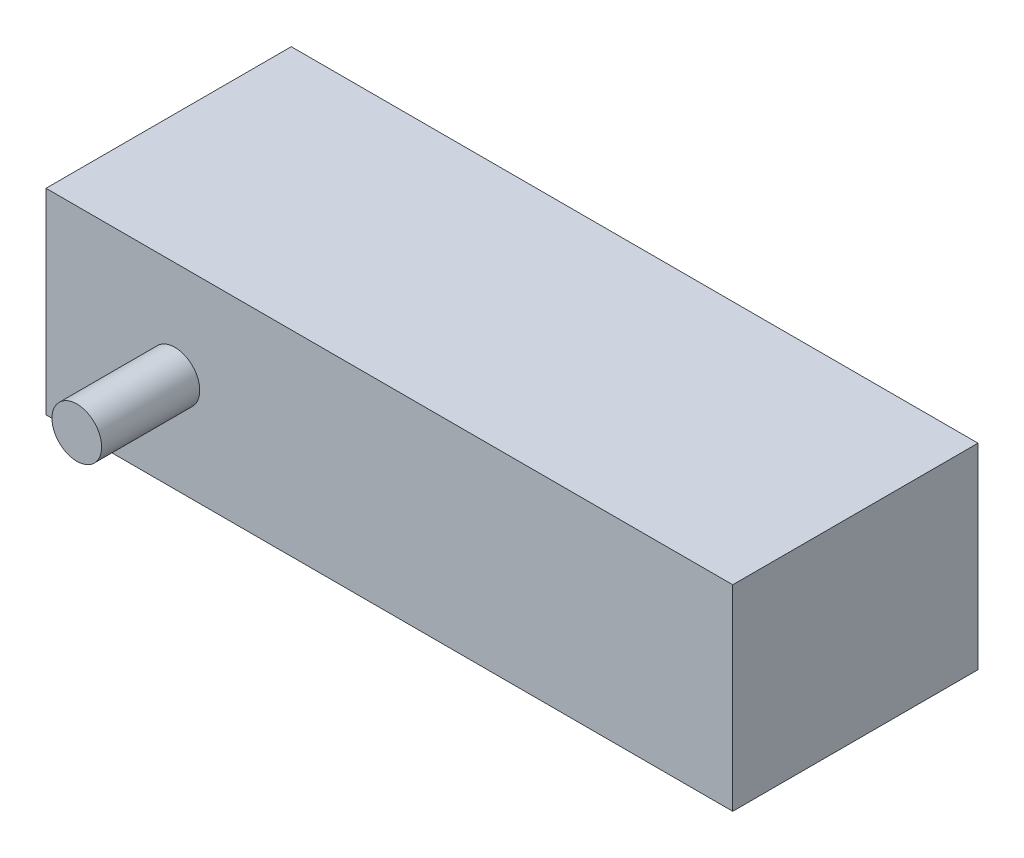
ISO-10303-21;
HEADER;
FILE_DESCRIPTION(('STEP AP214'),'2;1');
FILE_NAME('part.step','',(''),(''),'','','');
FILE_SCHEMA(('AUTOMOTIVE_DESIGN { 1 0 10303 214 1 1 1 1 }'));
ENDSEC;
DATA;
#1=APPLICATION_CONTEXT('core data for automotive mechanical design processes');
#2=APPLICATION_PROTOCOL_DEFINITION('international standard','automotive_design',2000,#1);
#3=PRODUCT_CONTEXT('',#1,'mechanical');
#4=PRODUCT('Part','Part','',(#3));
#5=PRODUCT_RELATED_PRODUCT_CATEGORY('part','',(#4));
#6=PRODUCT_DEFINITION_FORMATION('','',#4);
#7=PRODUCT_DEFINITION_CONTEXT('part definition',#1,'design');
#8=PRODUCT_DEFINITION('design','',#6,#7);
#9=PRODUCT_DEFINITION_SHAPE('','',#8);
#10=(LENGTH_UNIT() NAMED_UNIT(*) SI_UNIT(.MILLI.,.METRE.));
#11=(NAMED_UNIT(*) PLANE_ANGLE_UNIT() SI_UNIT($,.RADIAN.));
#12=(NAMED_UNIT(*) SI_UNIT($,.STERADIAN.) SOLID_ANGLE_UNIT());
#13=UNCERTAINTY_MEASURE_WITH_UNIT(LENGTH_MEASURE(1.E-05),#10,'distance_accuracy_value','');
#14=(GEOMETRIC_REPRESENTATION_CONTEXT(3) GLOBAL_UNCERTAINTY_ASSIGNED_CONTEXT((#13)) GLOBAL_UNIT_ASSIGNED_CONTEXT((#10,
#11,#12)) REPRESENTATION_CONTEXT('',''));
#15=CARTESIAN_POINT('',(0.,0.,0.));
#16=DIRECTION('',(0.,0.,1.));
#17=DIRECTION('',(1.,0.,0.));
#18=AXIS2_PLACEMENT_3D('',#15,#16,#17);
#19=CARTESIAN_POINT('',(35.,20.,12.5));
#20=DIRECTION('',(-1.,0.,0.));
#21=DIRECTION('',(0.,0.,1.));
#22=AXIS2_PLACEMENT_3D('',#19,#20,#21);
#23=PLANE('',#22);
#24=DIRECTION('',(0.,0.,-1.));
#25=VECTOR('',#24,1.);
#26=CARTESIAN_POINT('',(35.,0.,12.5));
#27=LINE('',#26,#25);
#28=CARTESIAN_POINT('',(35.,0.,12.5));
#29=VERTEX_POINT('',#28);
#30=CARTESIAN_POINT('',(35.,0.,-12.5));
#31=VERTEX_POINT('',#30);
#32=EDGE_CURVE('E99',#29,#31,#27,.T.);
#33=ORIENTED_EDGE('',*,*,#32,.T.);
#34=DIRECTION('',(0.,-1.,0.));
#35=VECTOR('',#34,1.);
#36=CARTESIAN_POINT('',(35.,20.,-12.5));
#37=LINE('',#36,#35);
#38=CARTESIAN_POINT('',(35.,20.,-12.5));
#39=VERTEX_POINT('',#38);
#40=EDGE_CURVE('E41',#39,#31,#37,.T.);
#41=ORIENTED_EDGE('',*,*,#40,.F.);
#42=DIRECTION('',(0.,0.,-1.));
#43=VECTOR('',#42,1.);
#44=CARTESIAN_POINT('',(35.,20.,12.5));
#45=LINE('',#44,#43);
#46=CARTESIAN_POINT('',(35.,20.,12.5));
#47=VERTEX_POINT('',#46);
#48=EDGE_CURVE('E85',#47,#39,#45,.T.);
#49=ORIENTED_EDGE('',*,*,#48,.F.);
#50=DIRECTION('',(0.,-1.,0.));
#51=VECTOR('',#50,1.);
#52=CARTESIAN_POINT('',(35.,20.,12.5));
#53=LINE('',#52,#51);
#54=EDGE_CURVE('E95',#47,#29,#53,.T.);
#55=ORIENTED_EDGE('',*,*,#54,.T.);
#56=EDGE_LOOP('',(#33,#41,#49,#55));
#57=FACE_BOUND('',#56,.T.);
#58=ADVANCED_FACE('F33',(#57),#23,.F.);
#59=CARTESIAN_POINT('',(-35.,20.,-12.5));
#60=DIRECTION('',(0.,0.,1.));
#61=DIRECTION('',(1.,0.,0.));
#62=AXIS2_PLACEMENT_3D('',#59,#60,#61);
#63=PLANE('',#62);
#64=DIRECTION('',(-1.,0.,0.));
#65=VECTOR('',#64,1.);
#66=CARTESIAN_POINT('',(-35.,0.,-12.5));
#67=LINE('',#66,#65);
#68=CARTESIAN_POINT('',(-35.,0.,-12.5));
#69=VERTEX_POINT('',#68);
#70=EDGE_CURVE('E90',#31,#69,#67,.T.);
#71=ORIENTED_EDGE('',*,*,#70,.T.);
#72=DIRECTION('',(0.,-1.,0.));
#73=VECTOR('',#72,1.);
#74=CARTESIAN_POINT('',(-35.,20.,-12.5));
#75=LINE('',#74,#73);
#76=CARTESIAN_POINT('',(-35.,20.,-12.5));
#77=VERTEX_POINT('',#76);
#78=EDGE_CURVE('E88',#77,#69,#75,.T.);
#79=ORIENTED_EDGE('',*,*,#78,.F.);
#80=DIRECTION('',(-1.,0.,0.));
#81=VECTOR('',#80,1.);
#82=CARTESIAN_POINT('',(-35.,20.,-12.5));
#83=LINE('',#82,#81);
#84=EDGE_CURVE('E80',#39,#77,#83,.T.);
#85=ORIENTED_EDGE('',*,*,#84,.F.);
#86=ORIENTED_EDGE('',*,*,#40,.T.);
#87=EDGE_LOOP('',(#71,#79,#85,#86));
#88=FACE_BOUND('',#87,.T.);
#89=ADVANCED_FACE('F89',(#88),#63,.F.);
#90=CARTESIAN_POINT('',(-35.,20.,12.5));
#91=DIRECTION('',(1.,0.,0.));
#92=DIRECTION('',(0.,0.,-1.));
#93=AXIS2_PLACEMENT_3D('',#90,#91,#92);
#94=PLANE('',#93);
#95=DIRECTION('',(0.,0.,1.));
#96=VECTOR('',#95,1.);
#97=CARTESIAN_POINT('',(-35.,0.,12.5));
#98=LINE('',#97,#96);
#99=CARTESIAN_POINT('',(-35.,0.,12.5));
#100=VERTEX_POINT('',#99);
#101=EDGE_CURVE('E66',#69,#100,#98,.T.);
#102=ORIENTED_EDGE('',*,*,#101,.T.);
#103=DIRECTION('',(0.,-1.,0.));
#104=VECTOR('',#103,1.);
#105=CARTESIAN_POINT('',(-35.,20.,12.5));
#106=LINE('',#105,#104);
#107=CARTESIAN_POINT('',(-35.,20.,12.5));
#108=VERTEX_POINT('',#107);
#109=EDGE_CURVE('E91',#108,#100,#106,.T.);
#110=ORIENTED_EDGE('',*,*,#109,.F.);
#111=DIRECTION('',(0.,0.,1.));
#112=VECTOR('',#111,1.);
#113=CARTESIAN_POINT('',(-35.,20.,12.5));
#114=LINE('',#113,#112);
#115=EDGE_CURVE('E83',#77,#108,#114,.T.);
#116=ORIENTED_EDGE('',*,*,#115,.F.);
#117=ORIENTED_EDGE('',*,*,#78,.T.);
#118=EDGE_LOOP('',(#102,#110,#116,#117));
#119=FACE_BOUND('',#118,.T.);
#120=ADVANCED_FACE('F93',(#119),#94,.F.);
#121=CARTESIAN_POINT('',(-35.,20.,12.5));
#122=DIRECTION('',(0.,0.,-1.));
#123=DIRECTION('',(-1.,0.,0.));
#124=AXIS2_PLACEMENT_3D('',#121,#122,#123);
#125=PLANE('',#124);
#126=CARTESIAN_POINT('',(-21.8588303719969,10.,12.5));
#127=DIRECTION('',(0.,0.,-1.));
#128=DIRECTION('',(-1.,0.,0.));
#129=AXIS2_PLACEMENT_3D('',#126,#127,#128);
#130=CIRCLE('',#129,2.53174595171776);
#131=CARTESIAN_POINT('',(-24.3905763237146,10.,12.5));
#132=VERTEX_POINT('',#131);
#133=EDGE_CURVE('E11',#132,#132,#130,.F.);
#134=ORIENTED_EDGE('',*,*,#133,.F.);
#135=EDGE_LOOP('',(#134));
#136=FACE_BOUND('',#135,.T.);
#137=DIRECTION('',(1.,0.,0.));
#138=VECTOR('',#137,1.);
#139=CARTESIAN_POINT('',(-35.,0.,12.5));
#140=LINE('',#139,#138);
#141=EDGE_CURVE('E72',#100,#29,#140,.T.);
#142=ORIENTED_EDGE('',*,*,#141,.T.);
#143=ORIENTED_EDGE('',*,*,#54,.F.);
#144=DIRECTION('',(1.,0.,0.));
#145=VECTOR('',#144,1.);
#146=CARTESIAN_POINT('',(-35.,20.,12.5));
#147=LINE('',#146,#145);
#148=EDGE_CURVE('E49',#108,#47,#147,.T.);
#149=ORIENTED_EDGE('',*,*,#148,.F.);
#150=ORIENTED_EDGE('',*,*,#109,.T.);
#151=EDGE_LOOP('',(#142,#143,#149,#150));
#152=FACE_BOUND('',#151,.T.);
#153=ADVANCED_FACE('F121',(#136,#152),#125,.F.);
#154=CARTESIAN_POINT('',(0.,20.,0.));
#155=DIRECTION('',(0.,-1.,0.));
#156=DIRECTION('',(0.,0.,-1.));
#157=AXIS2_PLACEMENT_3D('',#154,#155,#156);
#158=PLANE('',#157);
#159=ORIENTED_EDGE('',*,*,#48,.T.);
#160=ORIENTED_EDGE('',*,*,#84,.T.);
#161=ORIENTED_EDGE('',*,*,#115,.T.);
#162=ORIENTED_EDGE('',*,*,#148,.T.);
#163=EDGE_LOOP('',(#159,#160,#161,#162));
#164=FACE_BOUND('',#163,.T.);
#165=ADVANCED_FACE('F81',(#164),#158,.F.);
#166=CARTESIAN_POINT('',(0.,0.,0.));
#167=DIRECTION('',(0.,-1.,0.));
#168=DIRECTION('',(0.,0.,-1.));
#169=AXIS2_PLACEMENT_3D('',#166,#167,#168);
#170=PLANE('',#169);
#171=ORIENTED_EDGE('',*,*,#32,.F.);
#172=ORIENTED_EDGE('',*,*,#141,.F.);
#173=ORIENTED_EDGE('',*,*,#101,.F.);
#174=ORIENTED_EDGE('',*,*,#70,.F.);
#175=EDGE_LOOP('',(#171,#172,#173,#174));
#176=FACE_BOUND('',#175,.T.);
#177=ADVANCED_FACE('F110',(#176),#170,.T.);
#178=CARTESIAN_POINT('',(-21.8588303719969,10.,22.5));
#179=DIRECTION('',(0.,0.,-1.));
#180=DIRECTION('',(-1.,0.,0.));
#181=AXIS2_PLACEMENT_3D('',#178,#179,#180);
#182=CYLINDRICAL_SURFACE('',#181,2.53174595171776);
#183=CARTESIAN_POINT('',(-21.8588303719969,10.,22.5));
#184=DIRECTION('',(0.,0.,1.));
#185=DIRECTION('',(1.,0.,0.));
#186=AXIS2_PLACEMENT_3D('',#183,#184,#185);
#187=CIRCLE('',#186,2.53174595171776);
#188=CARTESIAN_POINT('',(-19.3270844202791,10.,22.5));
#189=VERTEX_POINT('',#188);
#190=EDGE_CURVE('E102',#189,#189,#187,.T.);
#191=ORIENTED_EDGE('',*,*,#190,.F.);
#192=EDGE_LOOP('',(#191));
#193=FACE_BOUND('',#192,.T.);
#194=ORIENTED_EDGE('',*,*,#133,.T.);
#195=EDGE_LOOP('',(#194));
#196=FACE_BOUND('',#195,.T.);
#197=ADVANCED_FACE('F112',(#193,#196),#182,.T.);
#198=CARTESIAN_POINT('',(-21.8588303719969,10.,22.5));
#199=DIRECTION('',(0.,0.,1.));
#200=DIRECTION('',(1.,0.,0.));
#201=AXIS2_PLACEMENT_3D('',#198,#199,#200);
#202=PLANE('',#201);
#203=ORIENTED_EDGE('',*,*,#190,.T.);
#204=EDGE_LOOP('',(#203));
#205=FACE_BOUND('',#204,.T.);
#206=ADVANCED_FACE('F118',(#205),#202,.T.);
#207=CLOSED_SHELL('',(#58,#89,#120,#153,#165,#177,#197,#206));
#208=MANIFOLD_SOLID_BREP('B2',#207);
#209=ADVANCED_BREP_SHAPE_REPRESENTATION('',(#18,#208),#14);
#210=SHAPE_DEFINITION_REPRESENTATION(#9,#209);
ENDSEC;
END-ISO-10303-21;
